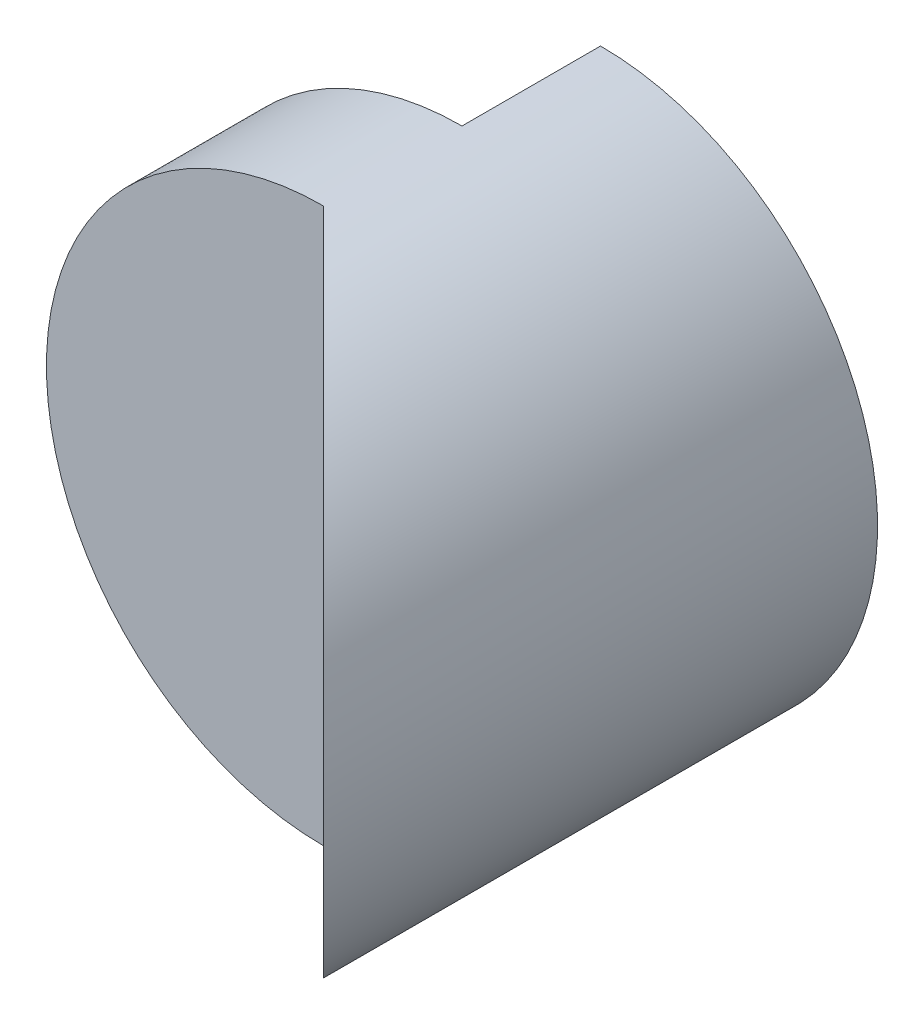
ISO-10303-21;
HEADER;
FILE_DESCRIPTION(('STEP AP214'),'2;1');
FILE_NAME('part.step','',(''),(''),'','','');
FILE_SCHEMA(('AUTOMOTIVE_DESIGN { 1 0 10303 214 1 1 1 1 }'));
ENDSEC;
DATA;
#1=APPLICATION_CONTEXT('core data for automotive mechanical design processes');
#2=APPLICATION_PROTOCOL_DEFINITION('international standard','automotive_design',2000,#1);
#3=PRODUCT_CONTEXT('',#1,'mechanical');
#4=PRODUCT('Part','Part','',(#3));
#5=PRODUCT_RELATED_PRODUCT_CATEGORY('part','',(#4));
#6=PRODUCT_DEFINITION_FORMATION('','',#4);
#7=PRODUCT_DEFINITION_CONTEXT('part definition',#1,'design');
#8=PRODUCT_DEFINITION('design','',#6,#7);
#9=PRODUCT_DEFINITION_SHAPE('','',#8);
#10=(LENGTH_UNIT() NAMED_UNIT(*) SI_UNIT(.MILLI.,.METRE.));
#11=(NAMED_UNIT(*) PLANE_ANGLE_UNIT() SI_UNIT($,.RADIAN.));
#12=(NAMED_UNIT(*) SI_UNIT($,.STERADIAN.) SOLID_ANGLE_UNIT());
#13=UNCERTAINTY_MEASURE_WITH_UNIT(LENGTH_MEASURE(1.E-05),#10,'distance_accuracy_value','');
#14=(GEOMETRIC_REPRESENTATION_CONTEXT(3) GLOBAL_UNCERTAINTY_ASSIGNED_CONTEXT((#13)) GLOBAL_UNIT_ASSIGNED_CONTEXT((#10,
#11,#12)) REPRESENTATION_CONTEXT('',''));
#15=CARTESIAN_POINT('',(0.,0.,0.));
#16=DIRECTION('',(0.,0.,1.));
#17=DIRECTION('',(1.,0.,0.));
#18=AXIS2_PLACEMENT_3D('',#15,#16,#17);
#19=CARTESIAN_POINT('',(0.,0.,40.));
#20=DIRECTION('',(0.,0.,-1.));
#21=DIRECTION('',(-1.,0.,0.));
#22=AXIS2_PLACEMENT_3D('',#19,#20,#21);
#23=CYLINDRICAL_SURFACE('',#22,20.);
#24=CARTESIAN_POINT('',(0.,0.,20.));
#25=DIRECTION('',(0.,0.,-1.));
#26=DIRECTION('',(-1.,0.,0.));
#27=AXIS2_PLACEMENT_3D('',#24,#25,#26);
#28=CIRCLE('',#27,20.);
#29=CARTESIAN_POINT('',(0.,-20.,20.));
#30=VERTEX_POINT('',#29);
#31=CARTESIAN_POINT('',(0.,20.,20.));
#32=VERTEX_POINT('',#31);
#33=EDGE_CURVE('E11',#30,#32,#28,.T.);
#34=ORIENTED_EDGE('',*,*,#33,.T.);
#35=CARTESIAN_POINT('',(0.,0.,20.));
#36=DIRECTION('',(0.707106781186548,0.,-0.707106781186548));
#37=DIRECTION('',(-0.707106781186548,0.,-0.707106781186548));
#38=AXIS2_PLACEMENT_3D('',#35,#36,#37);
#39=ELLIPSE('',#38,28.2842712474619,20.);
#40=EDGE_CURVE('E45',#32,#30,#39,.T.);
#41=ORIENTED_EDGE('',*,*,#40,.T.);
#42=EDGE_LOOP('',(#34,#41));
#43=FACE_BOUND('',#42,.T.);
#44=CARTESIAN_POINT('',(0.,0.,10.));
#45=DIRECTION('',(0.,0.,1.));
#46=DIRECTION('',(1.,0.,0.));
#47=AXIS2_PLACEMENT_3D('',#44,#45,#46);
#48=CIRCLE('',#47,20.);
#49=CARTESIAN_POINT('',(0.,20.,10.));
#50=VERTEX_POINT('',#49);
#51=CARTESIAN_POINT('',(0.,-20.,10.));
#52=VERTEX_POINT('',#51);
#53=EDGE_CURVE('E40',#50,#52,#48,.T.);
#54=ORIENTED_EDGE('',*,*,#53,.T.);
#55=DIRECTION('',(0.,0.,-1.));
#56=VECTOR('',#55,1.);
#57=CARTESIAN_POINT('',(0.,-20.,40.));
#58=LINE('',#57,#56);
#59=CARTESIAN_POINT('',(0.,-20.,0.));
#60=VERTEX_POINT('',#59);
#61=EDGE_CURVE('E78',#52,#60,#58,.T.);
#62=ORIENTED_EDGE('',*,*,#61,.T.);
#63=CARTESIAN_POINT('',(0.,0.,0.));
#64=DIRECTION('',(0.,0.,1.));
#65=DIRECTION('',(1.,0.,0.));
#66=AXIS2_PLACEMENT_3D('',#63,#64,#65);
#67=CIRCLE('',#66,20.);
#68=CARTESIAN_POINT('',(0.,20.,0.));
#69=VERTEX_POINT('',#68);
#70=EDGE_CURVE('E81',#60,#69,#67,.T.);
#71=ORIENTED_EDGE('',*,*,#70,.T.);
#72=DIRECTION('',(0.,0.,-1.));
#73=VECTOR('',#72,1.);
#74=CARTESIAN_POINT('',(0.,20.,40.));
#75=LINE('',#74,#73);
#76=EDGE_CURVE('E53',#69,#50,#75,.F.);
#77=ORIENTED_EDGE('',*,*,#76,.T.);
#78=EDGE_LOOP('',(#54,#62,#71,#77));
#79=FACE_BOUND('',#78,.T.);
#80=ADVANCED_FACE('F33',(#43,#79),#23,.T.);
#81=CARTESIAN_POINT('',(0.,0.,0.));
#82=DIRECTION('',(0.,0.,1.));
#83=DIRECTION('',(1.,0.,0.));
#84=AXIS2_PLACEMENT_3D('',#81,#82,#83);
#85=PLANE('',#84);
#86=ORIENTED_EDGE('',*,*,#70,.F.);
#87=DIRECTION('',(0.,1.,0.));
#88=VECTOR('',#87,1.);
#89=CARTESIAN_POINT('',(0.,0.,0.));
#90=LINE('',#89,#88);
#91=EDGE_CURVE('E84',#60,#69,#90,.T.);
#92=ORIENTED_EDGE('',*,*,#91,.T.);
#93=EDGE_LOOP('',(#86,#92));
#94=FACE_BOUND('',#93,.T.);
#95=ADVANCED_FACE('F92',(#94),#85,.F.);
#96=CARTESIAN_POINT('',(-20.,-40.,9.99999999999979));
#97=DIRECTION('',(0.,0.,1.));
#98=DIRECTION('',(1.,0.,0.));
#99=AXIS2_PLACEMENT_3D('',#96,#97,#98);
#100=PLANE('',#99);
#101=DIRECTION('',(0.,1.,0.));
#102=VECTOR('',#101,1.);
#103=CARTESIAN_POINT('',(0.,-40.,10.));
#104=LINE('',#103,#102);
#105=EDGE_CURVE('E71',#52,#50,#104,.T.);
#106=ORIENTED_EDGE('',*,*,#105,.F.);
#107=ORIENTED_EDGE('',*,*,#53,.F.);
#108=EDGE_LOOP('',(#106,#107));
#109=FACE_BOUND('',#108,.T.);
#110=ADVANCED_FACE('F89',(#109),#100,.F.);
#111=CARTESIAN_POINT('',(0.,-40.,0.));
#112=DIRECTION('',(1.,0.,0.));
#113=DIRECTION('',(0.,0.,-1.));
#114=AXIS2_PLACEMENT_3D('',#111,#112,#113);
#115=PLANE('',#114);
#116=ORIENTED_EDGE('',*,*,#105,.T.);
#117=ORIENTED_EDGE('',*,*,#76,.F.);
#118=ORIENTED_EDGE('',*,*,#91,.F.);
#119=ORIENTED_EDGE('',*,*,#61,.F.);
#120=EDGE_LOOP('',(#116,#117,#118,#119));
#121=FACE_BOUND('',#120,.T.);
#122=ADVANCED_FACE('F90',(#121),#115,.F.);
#123=CARTESIAN_POINT('',(-20.,-40.,20.));
#124=DIRECTION('',(0.,0.,-1.));
#125=DIRECTION('',(-1.,0.,0.));
#126=AXIS2_PLACEMENT_3D('',#123,#124,#125);
#127=PLANE('',#126);
#128=ORIENTED_EDGE('',*,*,#33,.F.);
#129=DIRECTION('',(0.,1.,0.));
#130=VECTOR('',#129,1.);
#131=CARTESIAN_POINT('',(0.,-40.,20.));
#132=LINE('',#131,#130);
#133=EDGE_CURVE('E70',#30,#32,#132,.T.);
#134=ORIENTED_EDGE('',*,*,#133,.T.);
#135=EDGE_LOOP('',(#128,#134));
#136=FACE_BOUND('',#135,.T.);
#137=ADVANCED_FACE('F73',(#136),#127,.F.);
#138=CARTESIAN_POINT('',(0.,-40.,20.));
#139=DIRECTION('',(0.707106781186548,0.,-0.707106781186548));
#140=DIRECTION('',(-0.707106781186548,0.,-0.707106781186548));
#141=AXIS2_PLACEMENT_3D('',#138,#139,#140);
#142=PLANE('',#141);
#143=ORIENTED_EDGE('',*,*,#133,.F.);
#144=ORIENTED_EDGE('',*,*,#40,.F.);
#145=EDGE_LOOP('',(#143,#144));
#146=FACE_BOUND('',#145,.T.);
#147=ADVANCED_FACE('F69',(#146),#142,.F.);
#148=CLOSED_SHELL('',(#80,#95,#110,#122,#137,#147));
#149=MANIFOLD_SOLID_BREP('B2',#148);
#150=ADVANCED_BREP_SHAPE_REPRESENTATION('',(#18,#149),#14);
#151=SHAPE_DEFINITION_REPRESENTATION(#9,#150);
ENDSEC;
END-ISO-10303-21;
